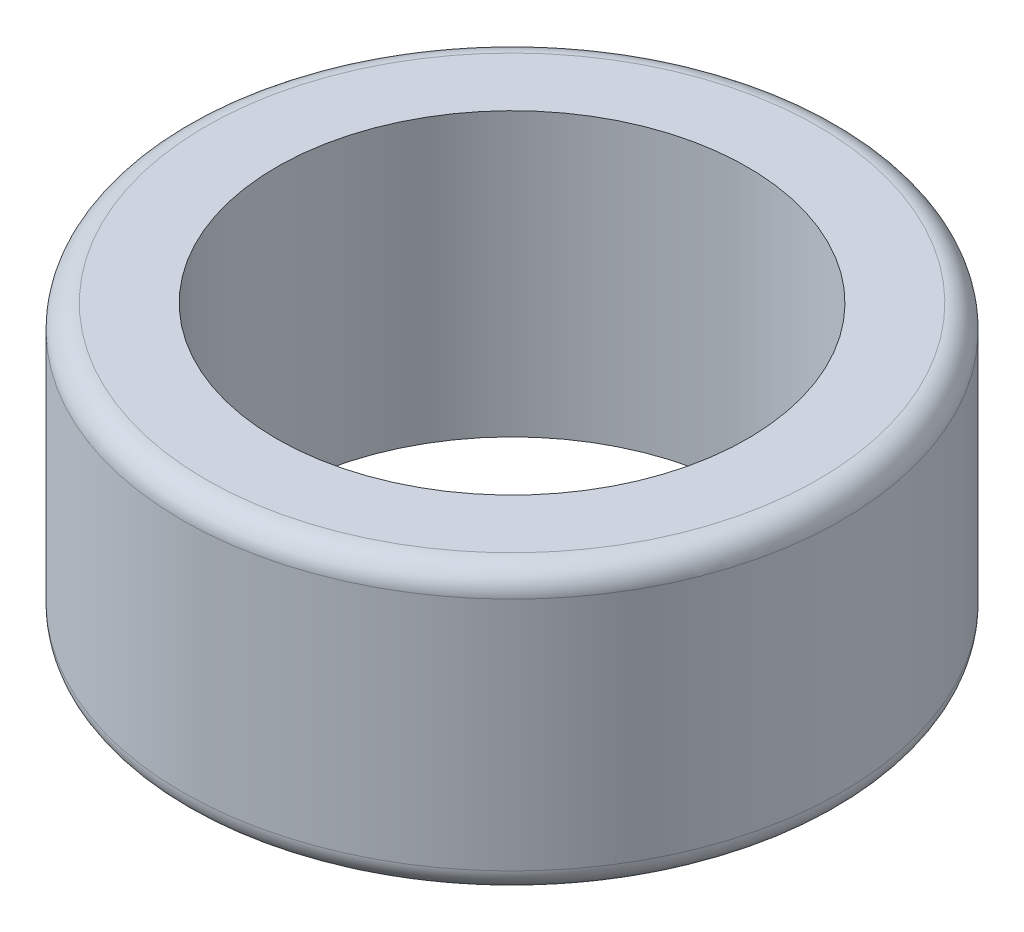
ISO-10303-21;
HEADER;
FILE_DESCRIPTION(('STEP AP214'),'2;1');
FILE_NAME('part.step','',(''),(''),'','','');
FILE_SCHEMA(('AUTOMOTIVE_DESIGN { 1 0 10303 214 1 1 1 1 }'));
ENDSEC;
DATA;
#1=APPLICATION_CONTEXT('core data for automotive mechanical design processes');
#2=APPLICATION_PROTOCOL_DEFINITION('international standard','automotive_design',2000,#1);
#3=PRODUCT_CONTEXT('',#1,'mechanical');
#4=PRODUCT('Part','Part','',(#3));
#5=PRODUCT_RELATED_PRODUCT_CATEGORY('part','',(#4));
#6=PRODUCT_DEFINITION_FORMATION('','',#4);
#7=PRODUCT_DEFINITION_CONTEXT('part definition',#1,'design');
#8=PRODUCT_DEFINITION('design','',#6,#7);
#9=PRODUCT_DEFINITION_SHAPE('','',#8);
#10=(LENGTH_UNIT() NAMED_UNIT(*) SI_UNIT(.MILLI.,.METRE.));
#11=(NAMED_UNIT(*) PLANE_ANGLE_UNIT() SI_UNIT($,.RADIAN.));
#12=(NAMED_UNIT(*) SI_UNIT($,.STERADIAN.) SOLID_ANGLE_UNIT());
#13=UNCERTAINTY_MEASURE_WITH_UNIT(LENGTH_MEASURE(1.E-05),#10,'distance_accuracy_value','');
#14=(GEOMETRIC_REPRESENTATION_CONTEXT(3) GLOBAL_UNCERTAINTY_ASSIGNED_CONTEXT((#13)) GLOBAL_UNIT_ASSIGNED_CONTEXT((#10,
#11,#12)) REPRESENTATION_CONTEXT('',''));
#15=CARTESIAN_POINT('',(0.,0.,0.));
#16=DIRECTION('',(0.,0.,1.));
#17=DIRECTION('',(1.,0.,0.));
#18=AXIS2_PLACEMENT_3D('',#15,#16,#17);
#19=CARTESIAN_POINT('',(0.,6.,0.));
#20=DIRECTION('',(0.,1.,0.));
#21=DIRECTION('',(0.,0.,1.));
#22=AXIS2_PLACEMENT_3D('',#19,#20,#21);
#23=PLANE('',#22);
#24=CARTESIAN_POINT('',(0.,6.,0.));
#25=DIRECTION('',(0.,1.,0.));
#26=DIRECTION('',(0.,0.,1.));
#27=AXIS2_PLACEMENT_3D('',#24,#25,#26);
#28=CIRCLE('',#27,6.5);
#29=CARTESIAN_POINT('',(0.,6.,6.5));
#30=VERTEX_POINT('',#29);
#31=EDGE_CURVE('E10',#30,#30,#28,.T.);
#32=ORIENTED_EDGE('',*,*,#31,.T.);
#33=EDGE_LOOP('',(#32));
#34=FACE_BOUND('',#33,.T.);
#35=CARTESIAN_POINT('',(0.,6.,0.));
#36=DIRECTION('',(0.,1.,0.));
#37=DIRECTION('',(0.,0.,1.));
#38=AXIS2_PLACEMENT_3D('',#35,#36,#37);
#39=CIRCLE('',#38,5.);
#40=CARTESIAN_POINT('',(0.,6.,5.));
#41=VERTEX_POINT('',#40);
#42=EDGE_CURVE('E61',#41,#41,#39,.T.);
#43=ORIENTED_EDGE('',*,*,#42,.F.);
#44=EDGE_LOOP('',(#43));
#45=FACE_BOUND('',#44,.T.);
#46=ADVANCED_FACE('F37',(#34,#45),#23,.T.);
#47=CARTESIAN_POINT('',(0.,0.,0.));
#48=DIRECTION('',(0.,1.,0.));
#49=DIRECTION('',(0.,0.,1.));
#50=AXIS2_PLACEMENT_3D('',#47,#48,#49);
#51=PLANE('',#50);
#52=CARTESIAN_POINT('',(0.,0.,0.));
#53=DIRECTION('',(0.,1.,0.));
#54=DIRECTION('',(0.,0.,1.));
#55=AXIS2_PLACEMENT_3D('',#52,#53,#54);
#56=CIRCLE('',#55,6.5);
#57=CARTESIAN_POINT('',(0.,0.,6.5));
#58=VERTEX_POINT('',#57);
#59=EDGE_CURVE('E45',#58,#58,#56,.F.);
#60=ORIENTED_EDGE('',*,*,#59,.T.);
#61=EDGE_LOOP('',(#60));
#62=FACE_BOUND('',#61,.T.);
#63=CARTESIAN_POINT('',(0.,0.,0.));
#64=DIRECTION('',(0.,1.,0.));
#65=DIRECTION('',(0.,0.,1.));
#66=AXIS2_PLACEMENT_3D('',#63,#64,#65);
#67=CIRCLE('',#66,5.);
#68=CARTESIAN_POINT('',(0.,0.,5.));
#69=VERTEX_POINT('',#68);
#70=EDGE_CURVE('E62',#69,#69,#67,.T.);
#71=ORIENTED_EDGE('',*,*,#70,.T.);
#72=EDGE_LOOP('',(#71));
#73=FACE_BOUND('',#72,.T.);
#74=ADVANCED_FACE('F74',(#62,#73),#51,.F.);
#75=CARTESIAN_POINT('',(0.,6.,0.));
#76=DIRECTION('',(0.,-1.,0.));
#77=DIRECTION('',(0.,0.,-1.));
#78=AXIS2_PLACEMENT_3D('',#75,#76,#77);
#79=CYLINDRICAL_SURFACE('',#78,7.);
#80=CARTESIAN_POINT('',(0.,0.5,0.));
#81=DIRECTION('',(0.,1.,0.));
#82=DIRECTION('',(0.,0.,1.));
#83=AXIS2_PLACEMENT_3D('',#80,#81,#82);
#84=CIRCLE('',#83,7.);
#85=CARTESIAN_POINT('',(0.,0.5,7.));
#86=VERTEX_POINT('',#85);
#87=EDGE_CURVE('E50',#86,#86,#84,.T.);
#88=ORIENTED_EDGE('',*,*,#87,.T.);
#89=EDGE_LOOP('',(#88));
#90=FACE_BOUND('',#89,.T.);
#91=CARTESIAN_POINT('',(0.,5.5,0.));
#92=DIRECTION('',(0.,1.,0.));
#93=DIRECTION('',(0.,0.,1.));
#94=AXIS2_PLACEMENT_3D('',#91,#92,#93);
#95=CIRCLE('',#94,7.);
#96=CARTESIAN_POINT('',(0.,5.5,7.));
#97=VERTEX_POINT('',#96);
#98=EDGE_CURVE('E55',#97,#97,#95,.F.);
#99=ORIENTED_EDGE('',*,*,#98,.T.);
#100=EDGE_LOOP('',(#99));
#101=FACE_BOUND('',#100,.T.);
#102=ADVANCED_FACE('F79',(#90,#101),#79,.T.);
#103=CARTESIAN_POINT('',(0.,6.,0.));
#104=DIRECTION('',(0.,-1.,0.));
#105=DIRECTION('',(0.,0.,-1.));
#106=AXIS2_PLACEMENT_3D('',#103,#104,#105);
#107=CYLINDRICAL_SURFACE('',#106,5.);
#108=ORIENTED_EDGE('',*,*,#42,.T.);
#109=EDGE_LOOP('',(#108));
#110=FACE_BOUND('',#109,.T.);
#111=ORIENTED_EDGE('',*,*,#70,.F.);
#112=EDGE_LOOP('',(#111));
#113=FACE_BOUND('',#112,.T.);
#114=ADVANCED_FACE('F70',(#110,#113),#107,.F.);
#115=CARTESIAN_POINT('',(0.,0.5,0.));
#116=DIRECTION('',(0.,1.,0.));
#117=DIRECTION('',(0.,0.,1.));
#118=AXIS2_PLACEMENT_3D('',#115,#116,#117);
#119=TOROIDAL_SURFACE('',#118,6.5,0.5);
#120=ORIENTED_EDGE('',*,*,#59,.F.);
#121=EDGE_LOOP('',(#120));
#122=FACE_BOUND('',#121,.T.);
#123=ORIENTED_EDGE('',*,*,#87,.F.);
#124=EDGE_LOOP('',(#123));
#125=FACE_BOUND('',#124,.T.);
#126=ADVANCED_FACE('F85',(#122,#125),#119,.T.);
#127=CARTESIAN_POINT('',(0.,5.5,0.));
#128=DIRECTION('',(0.,1.,0.));
#129=DIRECTION('',(0.,0.,1.));
#130=AXIS2_PLACEMENT_3D('',#127,#128,#129);
#131=TOROIDAL_SURFACE('',#130,6.5,0.5);
#132=ORIENTED_EDGE('',*,*,#98,.F.);
#133=EDGE_LOOP('',(#132));
#134=FACE_BOUND('',#133,.T.);
#135=ORIENTED_EDGE('',*,*,#31,.F.);
#136=EDGE_LOOP('',(#135));
#137=FACE_BOUND('',#136,.T.);
#138=ADVANCED_FACE('F39',(#134,#137),#131,.T.);
#139=CLOSED_SHELL('',(#46,#74,#102,#114,#126,#138));
#140=MANIFOLD_SOLID_BREP('B2',#139);
#141=ADVANCED_BREP_SHAPE_REPRESENTATION('',(#18,#140),#14);
#142=SHAPE_DEFINITION_REPRESENTATION(#9,#141);
ENDSEC;
END-ISO-10303-21;
